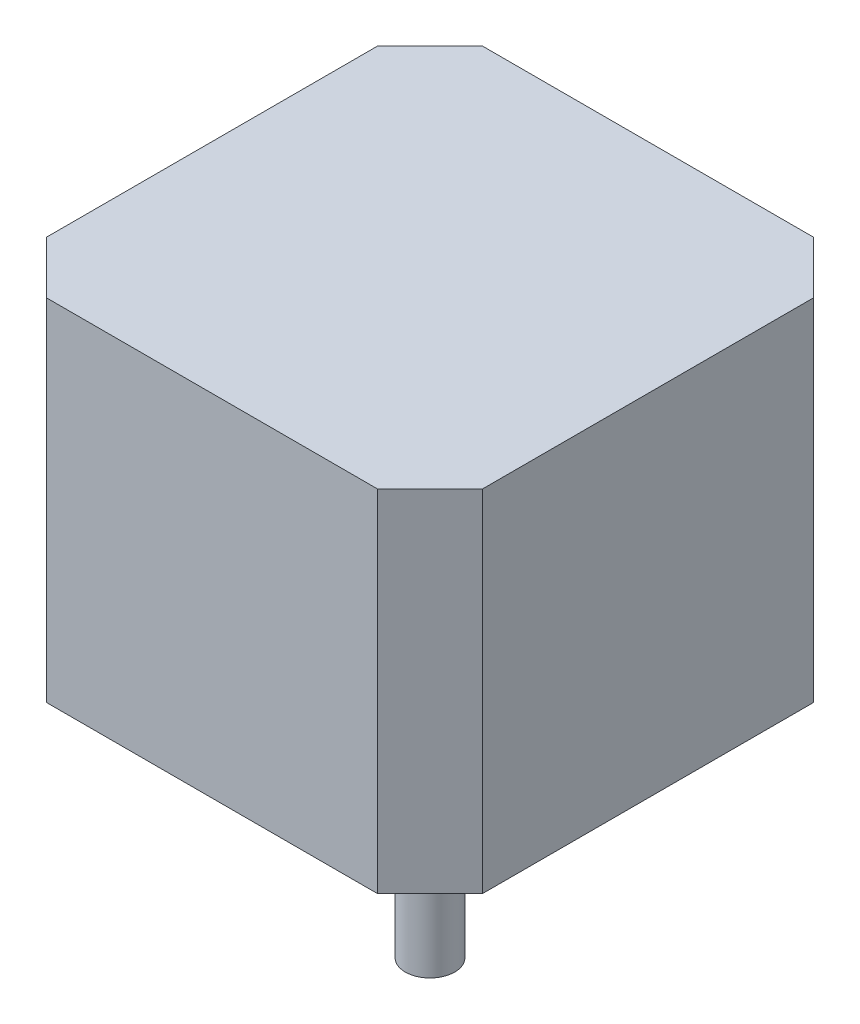
ISO-10303-21;
HEADER;
FILE_DESCRIPTION(('STEP AP214'),'2;1');
FILE_NAME('part.step','',(''),(''),'','','');
FILE_SCHEMA(('AUTOMOTIVE_DESIGN { 1 0 10303 214 1 1 1 1 }'));
ENDSEC;
DATA;
#1=APPLICATION_CONTEXT('core data for automotive mechanical design processes');
#2=APPLICATION_PROTOCOL_DEFINITION('international standard','automotive_design',2000,#1);
#3=PRODUCT_CONTEXT('',#1,'mechanical');
#4=PRODUCT('Part','Part','',(#3));
#5=PRODUCT_RELATED_PRODUCT_CATEGORY('part','',(#4));
#6=PRODUCT_DEFINITION_FORMATION('','',#4);
#7=PRODUCT_DEFINITION_CONTEXT('part definition',#1,'design');
#8=PRODUCT_DEFINITION('design','',#6,#7);
#9=PRODUCT_DEFINITION_SHAPE('','',#8);
#10=(LENGTH_UNIT() NAMED_UNIT(*) SI_UNIT(.MILLI.,.METRE.));
#11=(NAMED_UNIT(*) PLANE_ANGLE_UNIT() SI_UNIT($,.RADIAN.));
#12=(NAMED_UNIT(*) SI_UNIT($,.STERADIAN.) SOLID_ANGLE_UNIT());
#13=UNCERTAINTY_MEASURE_WITH_UNIT(LENGTH_MEASURE(1.E-05),#10,'distance_accuracy_value','');
#14=(GEOMETRIC_REPRESENTATION_CONTEXT(3) GLOBAL_UNCERTAINTY_ASSIGNED_CONTEXT((#13)) GLOBAL_UNIT_ASSIGNED_CONTEXT((#10,
#11,#12)) REPRESENTATION_CONTEXT('',''));
#15=CARTESIAN_POINT('',(0.,0.,0.));
#16=DIRECTION('',(0.,0.,1.));
#17=DIRECTION('',(1.,0.,0.));
#18=AXIS2_PLACEMENT_3D('',#15,#16,#17);
#19=CARTESIAN_POINT('',(-21.15,34.,-16.07));
#20=DIRECTION('',(0.707106781186547,0.,0.707106781186548));
#21=DIRECTION('',(0.707106781186548,0.,-0.707106781186547));
#22=AXIS2_PLACEMENT_3D('',#19,#20,#21);
#23=PLANE('',#22);
#24=DIRECTION('',(-0.707106781186548,0.,0.707106781186547));
#25=VECTOR('',#24,1.);
#26=CARTESIAN_POINT('',(-21.15,0.,-16.07));
#27=LINE('',#26,#25);
#28=CARTESIAN_POINT('',(-16.07,0.,-21.15));
#29=VERTEX_POINT('',#28);
#30=CARTESIAN_POINT('',(-21.15,0.,-16.07));
#31=VERTEX_POINT('',#30);
#32=EDGE_CURVE('E144',#29,#31,#27,.T.);
#33=ORIENTED_EDGE('',*,*,#32,.T.);
#34=DIRECTION('',(0.,-1.,0.));
#35=VECTOR('',#34,1.);
#36=CARTESIAN_POINT('',(-21.15,34.,-16.07));
#37=LINE('',#36,#35);
#38=CARTESIAN_POINT('',(-21.15,34.,-16.07));
#39=VERTEX_POINT('',#38);
#40=EDGE_CURVE('E39',#39,#31,#37,.T.);
#41=ORIENTED_EDGE('',*,*,#40,.F.);
#42=DIRECTION('',(-0.707106781186548,0.,0.707106781186547));
#43=VECTOR('',#42,1.);
#44=CARTESIAN_POINT('',(-21.15,34.,-16.07));
#45=LINE('',#44,#43);
#46=CARTESIAN_POINT('',(-16.07,34.,-21.15));
#47=VERTEX_POINT('',#46);
#48=EDGE_CURVE('E160',#47,#39,#45,.T.);
#49=ORIENTED_EDGE('',*,*,#48,.F.);
#50=DIRECTION('',(0.,-1.,0.));
#51=VECTOR('',#50,1.);
#52=CARTESIAN_POINT('',(-16.07,34.,-21.15));
#53=LINE('',#52,#51);
#54=EDGE_CURVE('E140',#47,#29,#53,.T.);
#55=ORIENTED_EDGE('',*,*,#54,.T.);
#56=EDGE_LOOP('',(#33,#41,#49,#55));
#57=FACE_BOUND('',#56,.T.);
#58=ADVANCED_FACE('F36',(#57),#23,.F.);
#59=CARTESIAN_POINT('',(-21.15,34.,16.07));
#60=DIRECTION('',(1.,0.,0.));
#61=DIRECTION('',(0.,0.,-1.));
#62=AXIS2_PLACEMENT_3D('',#59,#60,#61);
#63=PLANE('',#62);
#64=DIRECTION('',(0.,0.,1.));
#65=VECTOR('',#64,1.);
#66=CARTESIAN_POINT('',(-21.15,0.,16.07));
#67=LINE('',#66,#65);
#68=CARTESIAN_POINT('',(-21.15,0.,16.07));
#69=VERTEX_POINT('',#68);
#70=EDGE_CURVE('E147',#31,#69,#67,.T.);
#71=ORIENTED_EDGE('',*,*,#70,.T.);
#72=DIRECTION('',(0.,-1.,0.));
#73=VECTOR('',#72,1.);
#74=CARTESIAN_POINT('',(-21.15,34.,16.07));
#75=LINE('',#74,#73);
#76=CARTESIAN_POINT('',(-21.15,34.,16.07));
#77=VERTEX_POINT('',#76);
#78=EDGE_CURVE('E169',#77,#69,#75,.T.);
#79=ORIENTED_EDGE('',*,*,#78,.F.);
#80=DIRECTION('',(0.,0.,1.));
#81=VECTOR('',#80,1.);
#82=CARTESIAN_POINT('',(-21.15,34.,16.07));
#83=LINE('',#82,#81);
#84=EDGE_CURVE('E101',#39,#77,#83,.T.);
#85=ORIENTED_EDGE('',*,*,#84,.F.);
#86=ORIENTED_EDGE('',*,*,#40,.T.);
#87=EDGE_LOOP('',(#71,#79,#85,#86));
#88=FACE_BOUND('',#87,.T.);
#89=ADVANCED_FACE('F175',(#88),#63,.F.);
#90=CARTESIAN_POINT('',(-16.07,34.,21.15));
#91=DIRECTION('',(0.707106781186547,0.,-0.707106781186547));
#92=DIRECTION('',(-0.707106781186548,0.,-0.707106781186548));
#93=AXIS2_PLACEMENT_3D('',#90,#91,#92);
#94=PLANE('',#93);
#95=DIRECTION('',(0.707106781186548,0.,0.707106781186548));
#96=VECTOR('',#95,1.);
#97=CARTESIAN_POINT('',(-16.07,0.,21.15));
#98=LINE('',#97,#96);
#99=CARTESIAN_POINT('',(-16.07,0.,21.15));
#100=VERTEX_POINT('',#99);
#101=EDGE_CURVE('E150',#69,#100,#98,.T.);
#102=ORIENTED_EDGE('',*,*,#101,.T.);
#103=DIRECTION('',(0.,-1.,0.));
#104=VECTOR('',#103,1.);
#105=CARTESIAN_POINT('',(-16.07,34.,21.15));
#106=LINE('',#105,#104);
#107=CARTESIAN_POINT('',(-16.07,34.,21.15));
#108=VERTEX_POINT('',#107);
#109=EDGE_CURVE('E167',#108,#100,#106,.T.);
#110=ORIENTED_EDGE('',*,*,#109,.F.);
#111=DIRECTION('',(0.707106781186548,0.,0.707106781186548));
#112=VECTOR('',#111,1.);
#113=CARTESIAN_POINT('',(-16.07,34.,21.15));
#114=LINE('',#113,#112);
#115=EDGE_CURVE('E190',#77,#108,#114,.T.);
#116=ORIENTED_EDGE('',*,*,#115,.F.);
#117=ORIENTED_EDGE('',*,*,#78,.T.);
#118=EDGE_LOOP('',(#102,#110,#116,#117));
#119=FACE_BOUND('',#118,.T.);
#120=ADVANCED_FACE('F184',(#119),#94,.F.);
#121=CARTESIAN_POINT('',(16.07,34.,21.15));
#122=DIRECTION('',(0.,0.,-1.));
#123=DIRECTION('',(-1.,0.,0.));
#124=AXIS2_PLACEMENT_3D('',#121,#122,#123);
#125=PLANE('',#124);
#126=DIRECTION('',(1.,0.,0.));
#127=VECTOR('',#126,1.);
#128=CARTESIAN_POINT('',(16.07,0.,21.15));
#129=LINE('',#128,#127);
#130=CARTESIAN_POINT('',(16.07,0.,21.15));
#131=VERTEX_POINT('',#130);
#132=EDGE_CURVE('E152',#100,#131,#129,.T.);
#133=ORIENTED_EDGE('',*,*,#132,.T.);
#134=DIRECTION('',(0.,-1.,0.));
#135=VECTOR('',#134,1.);
#136=CARTESIAN_POINT('',(16.07,34.,21.15));
#137=LINE('',#136,#135);
#138=CARTESIAN_POINT('',(16.07,34.,21.15));
#139=VERTEX_POINT('',#138);
#140=EDGE_CURVE('E164',#139,#131,#137,.T.);
#141=ORIENTED_EDGE('',*,*,#140,.F.);
#142=DIRECTION('',(1.,0.,0.));
#143=VECTOR('',#142,1.);
#144=CARTESIAN_POINT('',(16.07,34.,21.15));
#145=LINE('',#144,#143);
#146=EDGE_CURVE('E189',#108,#139,#145,.T.);
#147=ORIENTED_EDGE('',*,*,#146,.F.);
#148=ORIENTED_EDGE('',*,*,#109,.T.);
#149=EDGE_LOOP('',(#133,#141,#147,#148));
#150=FACE_BOUND('',#149,.T.);
#151=ADVANCED_FACE('F187',(#150),#125,.F.);
#152=CARTESIAN_POINT('',(21.15,34.,16.07));
#153=DIRECTION('',(-0.707106781186548,0.,-0.707106781186547));
#154=DIRECTION('',(-0.707106781186547,0.,0.707106781186548));
#155=AXIS2_PLACEMENT_3D('',#152,#153,#154);
#156=PLANE('',#155);
#157=DIRECTION('',(0.707106781186547,0.,-0.707106781186548));
#158=VECTOR('',#157,1.);
#159=CARTESIAN_POINT('',(21.15,0.,16.07));
#160=LINE('',#159,#158);
#161=CARTESIAN_POINT('',(21.15,0.,16.07));
#162=VERTEX_POINT('',#161);
#163=EDGE_CURVE('E154',#131,#162,#160,.T.);
#164=ORIENTED_EDGE('',*,*,#163,.T.);
#165=DIRECTION('',(0.,-1.,0.));
#166=VECTOR('',#165,1.);
#167=CARTESIAN_POINT('',(21.15,34.,16.07));
#168=LINE('',#167,#166);
#169=CARTESIAN_POINT('',(21.15,34.,16.07));
#170=VERTEX_POINT('',#169);
#171=EDGE_CURVE('E135',#170,#162,#168,.T.);
#172=ORIENTED_EDGE('',*,*,#171,.F.);
#173=DIRECTION('',(0.707106781186547,0.,-0.707106781186548));
#174=VECTOR('',#173,1.);
#175=CARTESIAN_POINT('',(21.15,34.,16.07));
#176=LINE('',#175,#174);
#177=EDGE_CURVE('E123',#139,#170,#176,.T.);
#178=ORIENTED_EDGE('',*,*,#177,.F.);
#179=ORIENTED_EDGE('',*,*,#140,.T.);
#180=EDGE_LOOP('',(#164,#172,#178,#179));
#181=FACE_BOUND('',#180,.T.);
#182=ADVANCED_FACE('F298',(#181),#156,.F.);
#183=CARTESIAN_POINT('',(21.15,34.,-16.07));
#184=DIRECTION('',(-1.,0.,0.));
#185=DIRECTION('',(0.,0.,1.));
#186=AXIS2_PLACEMENT_3D('',#183,#184,#185);
#187=PLANE('',#186);
#188=DIRECTION('',(0.,0.,-1.));
#189=VECTOR('',#188,1.);
#190=CARTESIAN_POINT('',(21.15,0.,-16.07));
#191=LINE('',#190,#189);
#192=CARTESIAN_POINT('',(21.15,0.,-16.07));
#193=VERTEX_POINT('',#192);
#194=EDGE_CURVE('E132',#162,#193,#191,.T.);
#195=ORIENTED_EDGE('',*,*,#194,.T.);
#196=DIRECTION('',(0.,-1.,0.));
#197=VECTOR('',#196,1.);
#198=CARTESIAN_POINT('',(21.15,34.,-16.07));
#199=LINE('',#198,#197);
#200=CARTESIAN_POINT('',(21.15,34.,-16.07));
#201=VERTEX_POINT('',#200);
#202=EDGE_CURVE('E129',#201,#193,#199,.T.);
#203=ORIENTED_EDGE('',*,*,#202,.F.);
#204=DIRECTION('',(0.,0.,-1.));
#205=VECTOR('',#204,1.);
#206=CARTESIAN_POINT('',(21.15,34.,-16.07));
#207=LINE('',#206,#205);
#208=EDGE_CURVE('E116',#170,#201,#207,.T.);
#209=ORIENTED_EDGE('',*,*,#208,.F.);
#210=ORIENTED_EDGE('',*,*,#171,.T.);
#211=EDGE_LOOP('',(#195,#203,#209,#210));
#212=FACE_BOUND('',#211,.T.);
#213=ADVANCED_FACE('F130',(#212),#187,.F.);
#214=CARTESIAN_POINT('',(16.07,34.,-21.15));
#215=DIRECTION('',(-0.707106781186548,0.,0.707106781186547));
#216=DIRECTION('',(0.707106781186547,0.,0.707106781186548));
#217=AXIS2_PLACEMENT_3D('',#214,#215,#216);
#218=PLANE('',#217);
#219=DIRECTION('',(-0.707106781186547,0.,-0.707106781186548));
#220=VECTOR('',#219,1.);
#221=CARTESIAN_POINT('',(16.07,0.,-21.15));
#222=LINE('',#221,#220);
#223=CARTESIAN_POINT('',(16.07,0.,-21.15));
#224=VERTEX_POINT('',#223);
#225=EDGE_CURVE('E157',#193,#224,#222,.T.);
#226=ORIENTED_EDGE('',*,*,#225,.T.);
#227=DIRECTION('',(0.,-1.,0.));
#228=VECTOR('',#227,1.);
#229=CARTESIAN_POINT('',(16.07,34.,-21.15));
#230=LINE('',#229,#228);
#231=CARTESIAN_POINT('',(16.07,34.,-21.15));
#232=VERTEX_POINT('',#231);
#233=EDGE_CURVE('E136',#232,#224,#230,.T.);
#234=ORIENTED_EDGE('',*,*,#233,.F.);
#235=DIRECTION('',(-0.707106781186547,0.,-0.707106781186548));
#236=VECTOR('',#235,1.);
#237=CARTESIAN_POINT('',(16.07,34.,-21.15));
#238=LINE('',#237,#236);
#239=EDGE_CURVE('E120',#201,#232,#238,.T.);
#240=ORIENTED_EDGE('',*,*,#239,.F.);
#241=ORIENTED_EDGE('',*,*,#202,.T.);
#242=EDGE_LOOP('',(#226,#234,#240,#241));
#243=FACE_BOUND('',#242,.T.);
#244=ADVANCED_FACE('F138',(#243),#218,.F.);
#245=CARTESIAN_POINT('',(-16.07,34.,-21.15));
#246=DIRECTION('',(0.,0.,1.));
#247=DIRECTION('',(1.,0.,0.));
#248=AXIS2_PLACEMENT_3D('',#245,#246,#247);
#249=PLANE('',#248);
#250=DIRECTION('',(-1.,0.,0.));
#251=VECTOR('',#250,1.);
#252=CARTESIAN_POINT('',(-16.07,0.,-21.15));
#253=LINE('',#252,#251);
#254=EDGE_CURVE('E92',#224,#29,#253,.T.);
#255=ORIENTED_EDGE('',*,*,#254,.T.);
#256=ORIENTED_EDGE('',*,*,#54,.F.);
#257=DIRECTION('',(-1.,0.,0.));
#258=VECTOR('',#257,1.);
#259=CARTESIAN_POINT('',(-16.07,34.,-21.15));
#260=LINE('',#259,#258);
#261=EDGE_CURVE('E59',#232,#47,#260,.T.);
#262=ORIENTED_EDGE('',*,*,#261,.F.);
#263=ORIENTED_EDGE('',*,*,#233,.T.);
#264=EDGE_LOOP('',(#255,#256,#262,#263));
#265=FACE_BOUND('',#264,.T.);
#266=ADVANCED_FACE('F282',(#265),#249,.F.);
#267=CARTESIAN_POINT('',(0.,34.,0.));
#268=DIRECTION('',(0.,-1.,0.));
#269=DIRECTION('',(0.,0.,-1.));
#270=AXIS2_PLACEMENT_3D('',#267,#268,#269);
#271=PLANE('',#270);
#272=ORIENTED_EDGE('',*,*,#48,.T.);
#273=ORIENTED_EDGE('',*,*,#84,.T.);
#274=ORIENTED_EDGE('',*,*,#115,.T.);
#275=ORIENTED_EDGE('',*,*,#146,.T.);
#276=ORIENTED_EDGE('',*,*,#177,.T.);
#277=ORIENTED_EDGE('',*,*,#208,.T.);
#278=ORIENTED_EDGE('',*,*,#239,.T.);
#279=ORIENTED_EDGE('',*,*,#261,.T.);
#280=EDGE_LOOP('',(#272,#273,#274,#275,#276,#277,#278,#279));
#281=FACE_BOUND('',#280,.T.);
#282=ADVANCED_FACE('F118',(#281),#271,.F.);
#283=CARTESIAN_POINT('',(0.,0.,0.));
#284=DIRECTION('',(0.,-1.,0.));
#285=DIRECTION('',(0.,0.,-1.));
#286=AXIS2_PLACEMENT_3D('',#283,#284,#285);
#287=PLANE('',#286);
#288=CARTESIAN_POINT('',(0.,0.,0.));
#289=DIRECTION('',(0.,-1.,0.));
#290=DIRECTION('',(0.,0.,-1.));
#291=AXIS2_PLACEMENT_3D('',#288,#289,#290);
#292=CIRCLE('',#291,11.);
#293=CARTESIAN_POINT('',(0.,0.,-11.));
#294=VERTEX_POINT('',#293);
#295=EDGE_CURVE('E11',#294,#294,#292,.T.);
#296=ORIENTED_EDGE('',*,*,#295,.F.);
#297=EDGE_LOOP('',(#296));
#298=FACE_BOUND('',#297,.T.);
#299=CARTESIAN_POINT('',(15.5,0.,-15.5));
#300=DIRECTION('',(0.,-1.,0.));
#301=DIRECTION('',(0.,0.,-1.));
#302=AXIS2_PLACEMENT_3D('',#299,#300,#301);
#303=CIRCLE('',#302,1.24999999999999);
#304=CARTESIAN_POINT('',(15.5,0.,-16.75));
#305=VERTEX_POINT('',#304);
#306=EDGE_CURVE('E216',#305,#305,#303,.T.);
#307=ORIENTED_EDGE('',*,*,#306,.F.);
#308=EDGE_LOOP('',(#307));
#309=FACE_BOUND('',#308,.T.);
#310=CARTESIAN_POINT('',(-15.5,0.,-15.5));
#311=DIRECTION('',(0.,-1.,0.));
#312=DIRECTION('',(0.,0.,-1.));
#313=AXIS2_PLACEMENT_3D('',#310,#311,#312);
#314=CIRCLE('',#313,1.24999999999999);
#315=CARTESIAN_POINT('',(-15.5,0.,-16.75));
#316=VERTEX_POINT('',#315);
#317=EDGE_CURVE('E210',#316,#316,#314,.T.);
#318=ORIENTED_EDGE('',*,*,#317,.F.);
#319=EDGE_LOOP('',(#318));
#320=FACE_BOUND('',#319,.T.);
#321=CARTESIAN_POINT('',(-15.5,0.,15.5));
#322=DIRECTION('',(0.,-1.,0.));
#323=DIRECTION('',(0.,0.,-1.));
#324=AXIS2_PLACEMENT_3D('',#321,#322,#323);
#325=CIRCLE('',#324,1.24999999999999);
#326=CARTESIAN_POINT('',(-15.5,0.,14.25));
#327=VERTEX_POINT('',#326);
#328=EDGE_CURVE('E204',#327,#327,#325,.T.);
#329=ORIENTED_EDGE('',*,*,#328,.F.);
#330=EDGE_LOOP('',(#329));
#331=FACE_BOUND('',#330,.T.);
#332=CARTESIAN_POINT('',(15.5,0.,15.5));
#333=DIRECTION('',(0.,-1.,0.));
#334=DIRECTION('',(0.,0.,-1.));
#335=AXIS2_PLACEMENT_3D('',#332,#333,#334);
#336=CIRCLE('',#335,1.24999999999999);
#337=CARTESIAN_POINT('',(15.5,0.,14.25));
#338=VERTEX_POINT('',#337);
#339=EDGE_CURVE('E198',#338,#338,#336,.T.);
#340=ORIENTED_EDGE('',*,*,#339,.F.);
#341=EDGE_LOOP('',(#340));
#342=FACE_BOUND('',#341,.T.);
#343=ORIENTED_EDGE('',*,*,#32,.F.);
#344=ORIENTED_EDGE('',*,*,#254,.F.);
#345=ORIENTED_EDGE('',*,*,#225,.F.);
#346=ORIENTED_EDGE('',*,*,#194,.F.);
#347=ORIENTED_EDGE('',*,*,#163,.F.);
#348=ORIENTED_EDGE('',*,*,#132,.F.);
#349=ORIENTED_EDGE('',*,*,#101,.F.);
#350=ORIENTED_EDGE('',*,*,#70,.F.);
#351=EDGE_LOOP('',(#343,#344,#345,#346,#347,#348,#349,#350));
#352=FACE_BOUND('',#351,.T.);
#353=ADVANCED_FACE('F180',(#298,#309,#320,#331,#342,#352),#287,.T.);
#354=CARTESIAN_POINT('',(15.5,4.499991,15.5));
#355=DIRECTION('',(0.,-1.,0.));
#356=DIRECTION('',(0.,0.,-1.));
#357=AXIS2_PLACEMENT_3D('',#354,#355,#356);
#358=CONICAL_SURFACE('',#357,1.25,1.02974425867665);
#359=CARTESIAN_POINT('',(15.5,5.25106677378445,15.5));
#360=VERTEX_POINT('',#359);
#361=VERTEX_LOOP('',#360);
#362=FACE_BOUND('',#361,.T.);
#363=CARTESIAN_POINT('',(15.5,4.499991,15.5));
#364=DIRECTION('',(0.,-1.,0.));
#365=DIRECTION('',(0.,0.,-1.));
#366=AXIS2_PLACEMENT_3D('',#363,#364,#365);
#367=CIRCLE('',#366,1.25);
#368=CARTESIAN_POINT('',(15.5,4.499991,14.25));
#369=VERTEX_POINT('',#368);
#370=EDGE_CURVE('E148',#369,#369,#367,.T.);
#371=ORIENTED_EDGE('',*,*,#370,.T.);
#372=EDGE_LOOP('',(#371));
#373=FACE_BOUND('',#372,.T.);
#374=ADVANCED_FACE('F263',(#362,#373),#358,.F.);
#375=CARTESIAN_POINT('',(15.5,0.,15.5));
#376=DIRECTION('',(0.,-1.,0.));
#377=DIRECTION('',(0.,0.,-1.));
#378=AXIS2_PLACEMENT_3D('',#375,#376,#377);
#379=CYLINDRICAL_SURFACE('',#378,1.24999999999999);
#380=ORIENTED_EDGE('',*,*,#370,.F.);
#381=EDGE_LOOP('',(#380));
#382=FACE_BOUND('',#381,.T.);
#383=ORIENTED_EDGE('',*,*,#339,.T.);
#384=EDGE_LOOP('',(#383));
#385=FACE_BOUND('',#384,.T.);
#386=ADVANCED_FACE('F266',(#382,#385),#379,.F.);
#387=CARTESIAN_POINT('',(-15.5,4.499991,15.5));
#388=DIRECTION('',(0.,-1.,0.));
#389=DIRECTION('',(0.,0.,-1.));
#390=AXIS2_PLACEMENT_3D('',#387,#388,#389);
#391=CONICAL_SURFACE('',#390,1.25,1.02974425867665);
#392=CARTESIAN_POINT('',(-15.5,5.25106677378445,15.5));
#393=VERTEX_POINT('',#392);
#394=VERTEX_LOOP('',#393);
#395=FACE_BOUND('',#394,.T.);
#396=CARTESIAN_POINT('',(-15.5,4.499991,15.5));
#397=DIRECTION('',(0.,-1.,0.));
#398=DIRECTION('',(0.,0.,-1.));
#399=AXIS2_PLACEMENT_3D('',#396,#397,#398);
#400=CIRCLE('',#399,1.25);
#401=CARTESIAN_POINT('',(-15.5,4.499991,14.25));
#402=VERTEX_POINT('',#401);
#403=EDGE_CURVE('E201',#402,#402,#400,.T.);
#404=ORIENTED_EDGE('',*,*,#403,.T.);
#405=EDGE_LOOP('',(#404));
#406=FACE_BOUND('',#405,.T.);
#407=ADVANCED_FACE('F272',(#395,#406),#391,.F.);
#408=CARTESIAN_POINT('',(-15.5,0.,15.5));
#409=DIRECTION('',(0.,-1.,0.));
#410=DIRECTION('',(0.,0.,-1.));
#411=AXIS2_PLACEMENT_3D('',#408,#409,#410);
#412=CYLINDRICAL_SURFACE('',#411,1.24999999999999);
#413=ORIENTED_EDGE('',*,*,#403,.F.);
#414=EDGE_LOOP('',(#413));
#415=FACE_BOUND('',#414,.T.);
#416=ORIENTED_EDGE('',*,*,#328,.T.);
#417=EDGE_LOOP('',(#416));
#418=FACE_BOUND('',#417,.T.);
#419=ADVANCED_FACE('F339',(#415,#418),#412,.F.);
#420=CARTESIAN_POINT('',(-15.5,4.499991,-15.5));
#421=DIRECTION('',(0.,-1.,0.));
#422=DIRECTION('',(0.,0.,-1.));
#423=AXIS2_PLACEMENT_3D('',#420,#421,#422);
#424=CONICAL_SURFACE('',#423,1.25,1.02974425867665);
#425=CARTESIAN_POINT('',(-15.5,5.25106677378445,-15.5));
#426=VERTEX_POINT('',#425);
#427=VERTEX_LOOP('',#426);
#428=FACE_BOUND('',#427,.T.);
#429=CARTESIAN_POINT('',(-15.5,4.499991,-15.5));
#430=DIRECTION('',(0.,-1.,0.));
#431=DIRECTION('',(0.,0.,-1.));
#432=AXIS2_PLACEMENT_3D('',#429,#430,#431);
#433=CIRCLE('',#432,1.25);
#434=CARTESIAN_POINT('',(-15.5,4.499991,-16.75));
#435=VERTEX_POINT('',#434);
#436=EDGE_CURVE('E207',#435,#435,#433,.T.);
#437=ORIENTED_EDGE('',*,*,#436,.T.);
#438=EDGE_LOOP('',(#437));
#439=FACE_BOUND('',#438,.T.);
#440=ADVANCED_FACE('F348',(#428,#439),#424,.F.);
#441=CARTESIAN_POINT('',(-15.5,0.,-15.5));
#442=DIRECTION('',(0.,-1.,0.));
#443=DIRECTION('',(0.,0.,-1.));
#444=AXIS2_PLACEMENT_3D('',#441,#442,#443);
#445=CYLINDRICAL_SURFACE('',#444,1.24999999999999);
#446=ORIENTED_EDGE('',*,*,#436,.F.);
#447=EDGE_LOOP('',(#446));
#448=FACE_BOUND('',#447,.T.);
#449=ORIENTED_EDGE('',*,*,#317,.T.);
#450=EDGE_LOOP('',(#449));
#451=FACE_BOUND('',#450,.T.);
#452=ADVANCED_FACE('F360',(#448,#451),#445,.F.);
#453=CARTESIAN_POINT('',(15.5,4.499991,-15.5));
#454=DIRECTION('',(0.,-1.,0.));
#455=DIRECTION('',(0.,0.,-1.));
#456=AXIS2_PLACEMENT_3D('',#453,#454,#455);
#457=CONICAL_SURFACE('',#456,1.25,1.02974425867665);
#458=CARTESIAN_POINT('',(15.5,5.25106677378445,-15.5));
#459=VERTEX_POINT('',#458);
#460=VERTEX_LOOP('',#459);
#461=FACE_BOUND('',#460,.T.);
#462=CARTESIAN_POINT('',(15.5,4.499991,-15.5));
#463=DIRECTION('',(0.,-1.,0.));
#464=DIRECTION('',(0.,0.,-1.));
#465=AXIS2_PLACEMENT_3D('',#462,#463,#464);
#466=CIRCLE('',#465,1.25);
#467=CARTESIAN_POINT('',(15.5,4.499991,-16.75));
#468=VERTEX_POINT('',#467);
#469=EDGE_CURVE('E213',#468,#468,#466,.T.);
#470=ORIENTED_EDGE('',*,*,#469,.T.);
#471=EDGE_LOOP('',(#470));
#472=FACE_BOUND('',#471,.T.);
#473=ADVANCED_FACE('F370',(#461,#472),#457,.F.);
#474=CARTESIAN_POINT('',(15.5,0.,-15.5));
#475=DIRECTION('',(0.,-1.,0.));
#476=DIRECTION('',(0.,0.,-1.));
#477=AXIS2_PLACEMENT_3D('',#474,#475,#476);
#478=CYLINDRICAL_SURFACE('',#477,1.24999999999999);
#479=ORIENTED_EDGE('',*,*,#469,.F.);
#480=EDGE_LOOP('',(#479));
#481=FACE_BOUND('',#480,.T.);
#482=ORIENTED_EDGE('',*,*,#306,.T.);
#483=EDGE_LOOP('',(#482));
#484=FACE_BOUND('',#483,.T.);
#485=ADVANCED_FACE('F382',(#481,#484),#478,.F.);
#486=CARTESIAN_POINT('',(0.,-2.,0.));
#487=DIRECTION('',(0.,1.,0.));
#488=DIRECTION('',(0.,0.,1.));
#489=AXIS2_PLACEMENT_3D('',#486,#487,#488);
#490=CYLINDRICAL_SURFACE('',#489,11.);
#491=CARTESIAN_POINT('',(0.,-2.,0.));
#492=DIRECTION('',(0.,-1.,0.));
#493=DIRECTION('',(0.,0.,-1.));
#494=AXIS2_PLACEMENT_3D('',#491,#492,#493);
#495=CIRCLE('',#494,11.);
#496=CARTESIAN_POINT('',(0.,-2.,-11.));
#497=VERTEX_POINT('',#496);
#498=EDGE_CURVE('E218',#497,#497,#495,.T.);
#499=ORIENTED_EDGE('',*,*,#498,.F.);
#500=EDGE_LOOP('',(#499));
#501=FACE_BOUND('',#500,.T.);
#502=ORIENTED_EDGE('',*,*,#295,.T.);
#503=EDGE_LOOP('',(#502));
#504=FACE_BOUND('',#503,.T.);
#505=ADVANCED_FACE('F391',(#501,#504),#490,.T.);
#506=CARTESIAN_POINT('',(0.,-2.,0.));
#507=DIRECTION('',(0.,-1.,0.));
#508=DIRECTION('',(0.,0.,-1.));
#509=AXIS2_PLACEMENT_3D('',#506,#507,#508);
#510=PLANE('',#509);
#511=CARTESIAN_POINT('',(0.,-2.,0.));
#512=DIRECTION('',(0.,-1.,0.));
#513=DIRECTION('',(0.,0.,-1.));
#514=AXIS2_PLACEMENT_3D('',#511,#512,#513);
#515=CIRCLE('',#514,2.39600473839404);
#516=CARTESIAN_POINT('',(1.524,-2.,-1.84885443083189));
#517=VERTEX_POINT('',#516);
#518=CARTESIAN_POINT('',(-1.524,-2.,-1.84885443083189));
#519=VERTEX_POINT('',#518);
#520=EDGE_CURVE('E230',#517,#519,#515,.T.);
#521=ORIENTED_EDGE('',*,*,#520,.F.);
#522=DIRECTION('',(1.,0.,0.));
#523=VECTOR('',#522,1.);
#524=CARTESIAN_POINT('',(1.524,-2.,-1.84885443083189));
#525=LINE('',#524,#523);
#526=EDGE_CURVE('E50',#519,#517,#525,.T.);
#527=ORIENTED_EDGE('',*,*,#526,.F.);
#528=EDGE_LOOP('',(#521,#527));
#529=FACE_BOUND('',#528,.T.);
#530=ORIENTED_EDGE('',*,*,#498,.T.);
#531=EDGE_LOOP('',(#530));
#532=FACE_BOUND('',#531,.T.);
#533=ADVANCED_FACE('F406',(#529,#532),#510,.T.);
#534=CARTESIAN_POINT('',(0.,-24.,0.));
#535=DIRECTION('',(0.,1.,0.));
#536=DIRECTION('',(0.,0.,1.));
#537=AXIS2_PLACEMENT_3D('',#534,#535,#536);
#538=CYLINDRICAL_SURFACE('',#537,2.39600473839404);
#539=ORIENTED_EDGE('',*,*,#520,.T.);
#540=DIRECTION('',(0.,1.,0.));
#541=VECTOR('',#540,1.);
#542=CARTESIAN_POINT('',(-1.524,-24.,-1.84885443083189));
#543=LINE('',#542,#541);
#544=CARTESIAN_POINT('',(-1.524,-24.,-1.84885443083189));
#545=VERTEX_POINT('',#544);
#546=EDGE_CURVE('E222',#545,#519,#543,.T.);
#547=ORIENTED_EDGE('',*,*,#546,.F.);
#548=CARTESIAN_POINT('',(0.,-24.,0.));
#549=DIRECTION('',(0.,-1.,0.));
#550=DIRECTION('',(0.,0.,-1.));
#551=AXIS2_PLACEMENT_3D('',#548,#549,#550);
#552=CIRCLE('',#551,2.39600473839404);
#553=CARTESIAN_POINT('',(1.524,-24.,-1.84885443083189));
#554=VERTEX_POINT('',#553);
#555=EDGE_CURVE('E229',#554,#545,#552,.T.);
#556=ORIENTED_EDGE('',*,*,#555,.F.);
#557=DIRECTION('',(0.,1.,0.));
#558=VECTOR('',#557,1.);
#559=CARTESIAN_POINT('',(1.524,-24.,-1.84885443083189));
#560=LINE('',#559,#558);
#561=EDGE_CURVE('E224',#554,#517,#560,.T.);
#562=ORIENTED_EDGE('',*,*,#561,.T.);
#563=EDGE_LOOP('',(#539,#547,#556,#562));
#564=FACE_BOUND('',#563,.T.);
#565=ADVANCED_FACE('F247',(#564),#538,.T.);
#566=CARTESIAN_POINT('',(1.524,-24.,-1.84885443083189));
#567=DIRECTION('',(0.,0.,1.));
#568=DIRECTION('',(1.,0.,0.));
#569=AXIS2_PLACEMENT_3D('',#566,#567,#568);
#570=PLANE('',#569);
#571=ORIENTED_EDGE('',*,*,#526,.T.);
#572=ORIENTED_EDGE('',*,*,#561,.F.);
#573=DIRECTION('',(1.,0.,0.));
#574=VECTOR('',#573,1.);
#575=CARTESIAN_POINT('',(1.524,-24.,-1.84885443083189));
#576=LINE('',#575,#574);
#577=EDGE_CURVE('E227',#545,#554,#576,.T.);
#578=ORIENTED_EDGE('',*,*,#577,.F.);
#579=ORIENTED_EDGE('',*,*,#546,.T.);
#580=EDGE_LOOP('',(#571,#572,#578,#579));
#581=FACE_BOUND('',#580,.T.);
#582=ADVANCED_FACE('F249',(#581),#570,.F.);
#583=CARTESIAN_POINT('',(0.,-24.,0.));
#584=DIRECTION('',(0.,-1.,0.));
#585=DIRECTION('',(0.,0.,-1.));
#586=AXIS2_PLACEMENT_3D('',#583,#584,#585);
#587=PLANE('',#586);
#588=ORIENTED_EDGE('',*,*,#555,.T.);
#589=ORIENTED_EDGE('',*,*,#577,.T.);
#590=EDGE_LOOP('',(#588,#589));
#591=FACE_BOUND('',#590,.T.);
#592=ADVANCED_FACE('F240',(#591),#587,.T.);
#593=CLOSED_SHELL('',(#58,#89,#120,#151,#182,#213,#244,#266,#282,#353,#374,#386,#407,#419,#440,
#452,#473,#485,#505,#533,#565,#582,#592));
#594=MANIFOLD_SOLID_BREP('B2',#593);
#595=ADVANCED_BREP_SHAPE_REPRESENTATION('',(#18,#594),#14);
#596=SHAPE_DEFINITION_REPRESENTATION(#9,#595);
ENDSEC;
END-ISO-10303-21;
